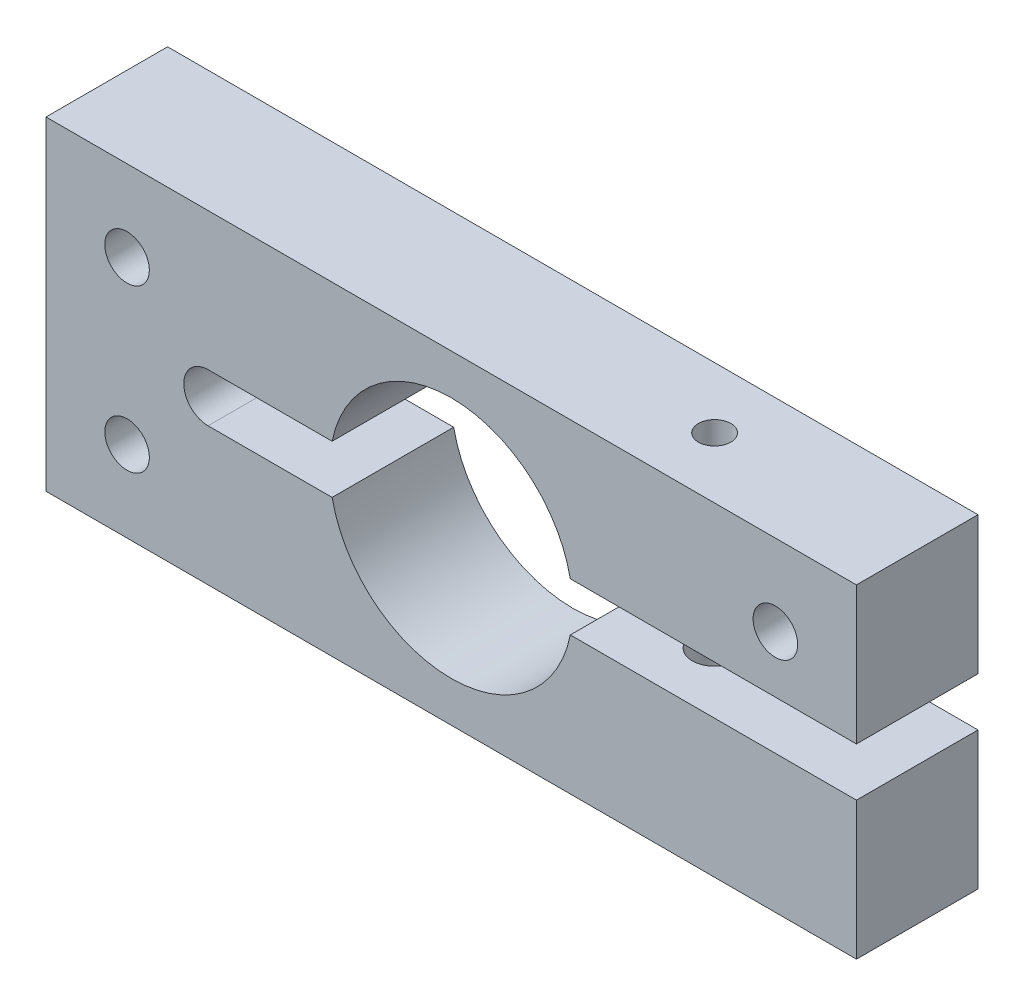
ISO-10303-21;
HEADER;
FILE_DESCRIPTION(('STEP AP214'),'2;1');
FILE_NAME('part.step','',(''),(''),'','','');
FILE_SCHEMA(('AUTOMOTIVE_DESIGN { 1 0 10303 214 1 1 1 1 }'));
ENDSEC;
DATA;
#1=APPLICATION_CONTEXT('core data for automotive mechanical design processes');
#2=APPLICATION_PROTOCOL_DEFINITION('international standard','automotive_design',2000,#1);
#3=PRODUCT_CONTEXT('',#1,'mechanical');
#4=PRODUCT('Part','Part','',(#3));
#5=PRODUCT_RELATED_PRODUCT_CATEGORY('part','',(#4));
#6=PRODUCT_DEFINITION_FORMATION('','',#4);
#7=PRODUCT_DEFINITION_CONTEXT('part definition',#1,'design');
#8=PRODUCT_DEFINITION('design','',#6,#7);
#9=PRODUCT_DEFINITION_SHAPE('','',#8);
#10=(LENGTH_UNIT() NAMED_UNIT(*) SI_UNIT(.MILLI.,.METRE.));
#11=(NAMED_UNIT(*) PLANE_ANGLE_UNIT() SI_UNIT($,.RADIAN.));
#12=(NAMED_UNIT(*) SI_UNIT($,.STERADIAN.) SOLID_ANGLE_UNIT());
#13=UNCERTAINTY_MEASURE_WITH_UNIT(LENGTH_MEASURE(1.E-05),#10,'distance_accuracy_value','');
#14=(GEOMETRIC_REPRESENTATION_CONTEXT(3) GLOBAL_UNCERTAINTY_ASSIGNED_CONTEXT((#13)) GLOBAL_UNIT_ASSIGNED_CONTEXT((#10,
#11,#12)) REPRESENTATION_CONTEXT('',''));
#15=CARTESIAN_POINT('',(0.,0.,0.));
#16=DIRECTION('',(0.,0.,1.));
#17=DIRECTION('',(1.,0.,0.));
#18=AXIS2_PLACEMENT_3D('',#15,#16,#17);
#19=CARTESIAN_POINT('',(50.,20.,0.));
#20=DIRECTION('',(0.,0.,1.));
#21=DIRECTION('',(1.,0.,0.));
#22=AXIS2_PLACEMENT_3D('',#19,#20,#21);
#23=PLANE('',#22);
#24=CARTESIAN_POINT('',(10.,30.,0.));
#25=DIRECTION('',(0.,0.,1.));
#26=DIRECTION('',(-1.,0.,0.));
#27=AXIS2_PLACEMENT_3D('',#24,#25,#26);
#28=CIRCLE('',#27,4.5);
#29=CARTESIAN_POINT('',(5.5,30.,0.));
#30=VERTEX_POINT('',#29);
#31=EDGE_CURVE('E216',#30,#30,#28,.T.);
#32=ORIENTED_EDGE('',*,*,#31,.T.);
#33=EDGE_LOOP('',(#32));
#34=FACE_BOUND('',#33,.T.);
#35=DIRECTION('',(0.,-1.,0.));
#36=VECTOR('',#35,1.);
#37=CARTESIAN_POINT('',(0.,0.,0.));
#38=LINE('',#37,#36);
#39=CARTESIAN_POINT('',(0.,40.,0.));
#40=VERTEX_POINT('',#39);
#41=CARTESIAN_POINT('',(0.,0.,0.));
#42=VERTEX_POINT('',#41);
#43=EDGE_CURVE('E156',#40,#42,#38,.T.);
#44=ORIENTED_EDGE('',*,*,#43,.F.);
#45=DIRECTION('',(-1.,0.,0.));
#46=VECTOR('',#45,1.);
#47=CARTESIAN_POINT('',(0.,40.,0.));
#48=LINE('',#47,#46);
#49=CARTESIAN_POINT('',(100.,40.,0.));
#50=VERTEX_POINT('',#49);
#51=EDGE_CURVE('E98',#50,#40,#48,.T.);
#52=ORIENTED_EDGE('',*,*,#51,.F.);
#53=DIRECTION('',(0.,1.,0.));
#54=VECTOR('',#53,1.);
#55=CARTESIAN_POINT('',(100.,23.,0.));
#56=LINE('',#55,#54);
#57=CARTESIAN_POINT('',(100.,23.,0.));
#58=VERTEX_POINT('',#57);
#59=EDGE_CURVE('E92',#58,#50,#56,.T.);
#60=ORIENTED_EDGE('',*,*,#59,.F.);
#61=DIRECTION('',(1.,0.,0.));
#62=VECTOR('',#61,1.);
#63=CARTESIAN_POINT('',(64.6969384566991,23.,0.));
#64=LINE('',#63,#62);
#65=CARTESIAN_POINT('',(64.6969384566991,23.,0.));
#66=VERTEX_POINT('',#65);
#67=EDGE_CURVE('E146',#66,#58,#64,.T.);
#68=ORIENTED_EDGE('',*,*,#67,.F.);
#69=CARTESIAN_POINT('',(50.,20.,0.));
#70=DIRECTION('',(0.,0.,-1.));
#71=DIRECTION('',(1.,0.,0.));
#72=AXIS2_PLACEMENT_3D('',#69,#70,#71);
#73=CIRCLE('',#72,15.);
#74=CARTESIAN_POINT('',(35.3030615433009,23.,0.));
#75=VERTEX_POINT('',#74);
#76=EDGE_CURVE('E174',#75,#66,#73,.T.);
#77=ORIENTED_EDGE('',*,*,#76,.F.);
#78=DIRECTION('',(1.,0.,0.));
#79=VECTOR('',#78,1.);
#80=CARTESIAN_POINT('',(20.,23.,0.));
#81=LINE('',#80,#79);
#82=CARTESIAN_POINT('',(20.,23.,0.));
#83=VERTEX_POINT('',#82);
#84=EDGE_CURVE('E172',#83,#75,#81,.T.);
#85=ORIENTED_EDGE('',*,*,#84,.F.);
#86=CARTESIAN_POINT('',(20.,20.,0.));
#87=DIRECTION('',(0.,0.,-1.));
#88=DIRECTION('',(1.,0.,0.));
#89=AXIS2_PLACEMENT_3D('',#86,#87,#88);
#90=CIRCLE('',#89,3.);
#91=CARTESIAN_POINT('',(20.,17.,0.));
#92=VERTEX_POINT('',#91);
#93=EDGE_CURVE('E170',#92,#83,#90,.T.);
#94=ORIENTED_EDGE('',*,*,#93,.F.);
#95=DIRECTION('',(-1.,0.,0.));
#96=VECTOR('',#95,1.);
#97=CARTESIAN_POINT('',(20.,17.,0.));
#98=LINE('',#97,#96);
#99=CARTESIAN_POINT('',(35.3030615433009,17.,0.));
#100=VERTEX_POINT('',#99);
#101=EDGE_CURVE('E168',#100,#92,#98,.T.);
#102=ORIENTED_EDGE('',*,*,#101,.F.);
#103=CARTESIAN_POINT('',(50.,20.,0.));
#104=DIRECTION('',(0.,0.,-1.));
#105=DIRECTION('',(1.,0.,0.));
#106=AXIS2_PLACEMENT_3D('',#103,#104,#105);
#107=CIRCLE('',#106,15.);
#108=CARTESIAN_POINT('',(64.6969384566991,17.,0.));
#109=VERTEX_POINT('',#108);
#110=EDGE_CURVE('E166',#109,#100,#107,.T.);
#111=ORIENTED_EDGE('',*,*,#110,.F.);
#112=DIRECTION('',(-1.,0.,0.));
#113=VECTOR('',#112,1.);
#114=CARTESIAN_POINT('',(64.6969384566991,17.,0.));
#115=LINE('',#114,#113);
#116=CARTESIAN_POINT('',(100.,17.,0.));
#117=VERTEX_POINT('',#116);
#118=EDGE_CURVE('E164',#117,#109,#115,.T.);
#119=ORIENTED_EDGE('',*,*,#118,.F.);
#120=DIRECTION('',(0.,1.,0.));
#121=VECTOR('',#120,1.);
#122=CARTESIAN_POINT('',(100.,0.,0.));
#123=LINE('',#122,#121);
#124=CARTESIAN_POINT('',(100.,0.,0.));
#125=VERTEX_POINT('',#124);
#126=EDGE_CURVE('E162',#125,#117,#123,.T.);
#127=ORIENTED_EDGE('',*,*,#126,.F.);
#128=DIRECTION('',(1.,0.,0.));
#129=VECTOR('',#128,1.);
#130=CARTESIAN_POINT('',(0.,0.,0.));
#131=LINE('',#130,#129);
#132=EDGE_CURVE('E159',#42,#125,#131,.T.);
#133=ORIENTED_EDGE('',*,*,#132,.F.);
#134=EDGE_LOOP('',(#44,#52,#60,#68,#77,#85,#94,#102,#111,#119,#127,#133));
#135=FACE_BOUND('',#134,.T.);
#136=CARTESIAN_POINT('',(10.,10.,0.));
#137=DIRECTION('',(0.,0.,1.));
#138=DIRECTION('',(1.,0.,0.));
#139=AXIS2_PLACEMENT_3D('',#136,#137,#138);
#140=CIRCLE('',#139,4.5);
#141=CARTESIAN_POINT('',(14.5,10.,0.));
#142=VERTEX_POINT('',#141);
#143=EDGE_CURVE('E209',#142,#142,#140,.T.);
#144=ORIENTED_EDGE('',*,*,#143,.T.);
#145=EDGE_LOOP('',(#144));
#146=FACE_BOUND('',#145,.T.);
#147=CARTESIAN_POINT('',(90.,30.,0.));
#148=DIRECTION('',(0.,0.,1.));
#149=DIRECTION('',(1.,0.,0.));
#150=AXIS2_PLACEMENT_3D('',#147,#148,#149);
#151=CIRCLE('',#150,4.49999999999999);
#152=CARTESIAN_POINT('',(94.5,30.,0.));
#153=VERTEX_POINT('',#152);
#154=EDGE_CURVE('E223',#153,#153,#151,.T.);
#155=ORIENTED_EDGE('',*,*,#154,.T.);
#156=EDGE_LOOP('',(#155));
#157=FACE_BOUND('',#156,.T.);
#158=ADVANCED_FACE('F32',(#34,#135,#146,#157),#23,.F.);
#159=CARTESIAN_POINT('',(10.,30.,15.));
#160=DIRECTION('',(0.,0.,-1.));
#161=DIRECTION('',(-1.,0.,0.));
#162=AXIS2_PLACEMENT_3D('',#159,#160,#161);
#163=CYLINDRICAL_SURFACE('',#162,2.75);
#164=CARTESIAN_POINT('',(10.,30.,15.));
#165=DIRECTION('',(0.,0.,1.));
#166=DIRECTION('',(1.,0.,0.));
#167=AXIS2_PLACEMENT_3D('',#164,#165,#166);
#168=CIRCLE('',#167,2.75);
#169=CARTESIAN_POINT('',(12.75,30.,15.));
#170=VERTEX_POINT('',#169);
#171=EDGE_CURVE('E160',#170,#170,#168,.T.);
#172=ORIENTED_EDGE('',*,*,#171,.T.);
#173=EDGE_LOOP('',(#172));
#174=FACE_BOUND('',#173,.T.);
#175=CARTESIAN_POINT('',(10.,30.,5.));
#176=DIRECTION('',(0.,0.,-1.));
#177=DIRECTION('',(-1.,0.,0.));
#178=AXIS2_PLACEMENT_3D('',#175,#176,#177);
#179=CIRCLE('',#178,2.75);
#180=CARTESIAN_POINT('',(7.25,30.,5.));
#181=VERTEX_POINT('',#180);
#182=EDGE_CURVE('E207',#181,#181,#179,.T.);
#183=ORIENTED_EDGE('',*,*,#182,.T.);
#184=EDGE_LOOP('',(#183));
#185=FACE_BOUND('',#184,.T.);
#186=ADVANCED_FACE('F292',(#174,#185),#163,.F.);
#187=CARTESIAN_POINT('',(50.,20.,15.));
#188=DIRECTION('',(0.,0.,1.));
#189=DIRECTION('',(1.,0.,0.));
#190=AXIS2_PLACEMENT_3D('',#187,#188,#189);
#191=PLANE('',#190);
#192=CARTESIAN_POINT('',(10.,10.,15.));
#193=DIRECTION('',(0.,0.,1.));
#194=DIRECTION('',(-1.,0.,0.));
#195=AXIS2_PLACEMENT_3D('',#192,#193,#194);
#196=CIRCLE('',#195,2.75);
#197=CARTESIAN_POINT('',(7.25,10.,15.));
#198=VERTEX_POINT('',#197);
#199=EDGE_CURVE('E242',#198,#198,#196,.T.);
#200=ORIENTED_EDGE('',*,*,#199,.F.);
#201=EDGE_LOOP('',(#200));
#202=FACE_BOUND('',#201,.T.);
#203=DIRECTION('',(0.,-1.,0.));
#204=VECTOR('',#203,1.);
#205=CARTESIAN_POINT('',(0.,0.,15.));
#206=LINE('',#205,#204);
#207=CARTESIAN_POINT('',(0.,40.,15.));
#208=VERTEX_POINT('',#207);
#209=CARTESIAN_POINT('',(0.,0.,15.));
#210=VERTEX_POINT('',#209);
#211=EDGE_CURVE('E179',#208,#210,#206,.T.);
#212=ORIENTED_EDGE('',*,*,#211,.T.);
#213=DIRECTION('',(1.,0.,0.));
#214=VECTOR('',#213,1.);
#215=CARTESIAN_POINT('',(0.,0.,15.));
#216=LINE('',#215,#214);
#217=CARTESIAN_POINT('',(100.,0.,15.));
#218=VERTEX_POINT('',#217);
#219=EDGE_CURVE('E106',#210,#218,#216,.T.);
#220=ORIENTED_EDGE('',*,*,#219,.T.);
#221=DIRECTION('',(0.,1.,0.));
#222=VECTOR('',#221,1.);
#223=CARTESIAN_POINT('',(100.,0.,15.));
#224=LINE('',#223,#222);
#225=CARTESIAN_POINT('',(100.,17.,15.));
#226=VERTEX_POINT('',#225);
#227=EDGE_CURVE('E249',#218,#226,#224,.T.);
#228=ORIENTED_EDGE('',*,*,#227,.T.);
#229=DIRECTION('',(-1.,0.,0.));
#230=VECTOR('',#229,1.);
#231=CARTESIAN_POINT('',(64.6969384566991,17.,15.));
#232=LINE('',#231,#230);
#233=CARTESIAN_POINT('',(64.6969384566991,17.,15.));
#234=VERTEX_POINT('',#233);
#235=EDGE_CURVE('E251',#226,#234,#232,.T.);
#236=ORIENTED_EDGE('',*,*,#235,.T.);
#237=CARTESIAN_POINT('',(50.,20.,15.));
#238=DIRECTION('',(0.,0.,-1.));
#239=DIRECTION('',(1.,0.,0.));
#240=AXIS2_PLACEMENT_3D('',#237,#238,#239);
#241=CIRCLE('',#240,15.);
#242=CARTESIAN_POINT('',(35.3030615433009,17.,15.));
#243=VERTEX_POINT('',#242);
#244=EDGE_CURVE('E253',#234,#243,#241,.T.);
#245=ORIENTED_EDGE('',*,*,#244,.T.);
#246=DIRECTION('',(-1.,0.,0.));
#247=VECTOR('',#246,1.);
#248=CARTESIAN_POINT('',(20.,17.,15.));
#249=LINE('',#248,#247);
#250=CARTESIAN_POINT('',(20.,17.,15.));
#251=VERTEX_POINT('',#250);
#252=EDGE_CURVE('E255',#243,#251,#249,.T.);
#253=ORIENTED_EDGE('',*,*,#252,.T.);
#254=CARTESIAN_POINT('',(20.,20.,15.));
#255=DIRECTION('',(0.,0.,-1.));
#256=DIRECTION('',(1.,0.,0.));
#257=AXIS2_PLACEMENT_3D('',#254,#255,#256);
#258=CIRCLE('',#257,3.);
#259=CARTESIAN_POINT('',(20.,23.,15.));
#260=VERTEX_POINT('',#259);
#261=EDGE_CURVE('E257',#251,#260,#258,.T.);
#262=ORIENTED_EDGE('',*,*,#261,.T.);
#263=DIRECTION('',(1.,0.,0.));
#264=VECTOR('',#263,1.);
#265=CARTESIAN_POINT('',(20.,23.,15.));
#266=LINE('',#265,#264);
#267=CARTESIAN_POINT('',(35.3030615433009,23.,15.));
#268=VERTEX_POINT('',#267);
#269=EDGE_CURVE('E259',#260,#268,#266,.T.);
#270=ORIENTED_EDGE('',*,*,#269,.T.);
#271=CARTESIAN_POINT('',(50.,20.,15.));
#272=DIRECTION('',(0.,0.,-1.));
#273=DIRECTION('',(1.,0.,0.));
#274=AXIS2_PLACEMENT_3D('',#271,#272,#273);
#275=CIRCLE('',#274,15.);
#276=CARTESIAN_POINT('',(64.6969384566991,23.,15.));
#277=VERTEX_POINT('',#276);
#278=EDGE_CURVE('E138',#268,#277,#275,.T.);
#279=ORIENTED_EDGE('',*,*,#278,.T.);
#280=DIRECTION('',(1.,0.,0.));
#281=VECTOR('',#280,1.);
#282=CARTESIAN_POINT('',(64.6969384566991,23.,15.));
#283=LINE('',#282,#281);
#284=CARTESIAN_POINT('',(100.,23.,15.));
#285=VERTEX_POINT('',#284);
#286=EDGE_CURVE('E131',#277,#285,#283,.T.);
#287=ORIENTED_EDGE('',*,*,#286,.T.);
#288=DIRECTION('',(0.,1.,0.));
#289=VECTOR('',#288,1.);
#290=CARTESIAN_POINT('',(100.,23.,15.));
#291=LINE('',#290,#289);
#292=CARTESIAN_POINT('',(100.,40.,15.));
#293=VERTEX_POINT('',#292);
#294=EDGE_CURVE('E136',#285,#293,#291,.T.);
#295=ORIENTED_EDGE('',*,*,#294,.T.);
#296=DIRECTION('',(-1.,0.,0.));
#297=VECTOR('',#296,1.);
#298=CARTESIAN_POINT('',(0.,40.,15.));
#299=LINE('',#298,#297);
#300=EDGE_CURVE('E51',#293,#208,#299,.T.);
#301=ORIENTED_EDGE('',*,*,#300,.T.);
#302=EDGE_LOOP('',(#212,#220,#228,#236,#245,#253,#262,#270,#279,#287,#295,#301));
#303=FACE_BOUND('',#302,.T.);
#304=ORIENTED_EDGE('',*,*,#171,.F.);
#305=EDGE_LOOP('',(#304));
#306=FACE_BOUND('',#305,.T.);
#307=CARTESIAN_POINT('',(90.,30.,15.));
#308=DIRECTION('',(0.,0.,1.));
#309=DIRECTION('',(-1.,0.,0.));
#310=AXIS2_PLACEMENT_3D('',#307,#308,#309);
#311=CIRCLE('',#310,2.74999999999999);
#312=CARTESIAN_POINT('',(87.25,30.,15.));
#313=VERTEX_POINT('',#312);
#314=EDGE_CURVE('E239',#313,#313,#311,.T.);
#315=ORIENTED_EDGE('',*,*,#314,.F.);
#316=EDGE_LOOP('',(#315));
#317=FACE_BOUND('',#316,.T.);
#318=ADVANCED_FACE('F133',(#202,#303,#306,#317),#191,.T.);
#319=CARTESIAN_POINT('',(0.,0.,15.));
#320=DIRECTION('',(1.,0.,0.));
#321=DIRECTION('',(0.,0.,-1.));
#322=AXIS2_PLACEMENT_3D('',#319,#320,#321);
#323=PLANE('',#322);
#324=ORIENTED_EDGE('',*,*,#43,.T.);
#325=DIRECTION('',(0.,0.,-1.));
#326=VECTOR('',#325,1.);
#327=CARTESIAN_POINT('',(0.,0.,15.));
#328=LINE('',#327,#326);
#329=EDGE_CURVE('E11',#210,#42,#328,.T.);
#330=ORIENTED_EDGE('',*,*,#329,.F.);
#331=ORIENTED_EDGE('',*,*,#211,.F.);
#332=DIRECTION('',(0.,0.,-1.));
#333=VECTOR('',#332,1.);
#334=CARTESIAN_POINT('',(0.,40.,15.));
#335=LINE('',#334,#333);
#336=EDGE_CURVE('E152',#208,#40,#335,.T.);
#337=ORIENTED_EDGE('',*,*,#336,.T.);
#338=EDGE_LOOP('',(#324,#330,#331,#337));
#339=FACE_BOUND('',#338,.T.);
#340=ADVANCED_FACE('F34',(#339),#323,.F.);
#341=CARTESIAN_POINT('',(0.,0.,15.));
#342=DIRECTION('',(0.,1.,0.));
#343=DIRECTION('',(0.,0.,1.));
#344=AXIS2_PLACEMENT_3D('',#341,#342,#343);
#345=PLANE('',#344);
#346=CARTESIAN_POINT('',(75.,0.,7.5));
#347=DIRECTION('',(0.,-1.,0.));
#348=DIRECTION('',(0.,0.,-1.));
#349=AXIS2_PLACEMENT_3D('',#346,#347,#348);
#350=CIRCLE('',#349,4.5);
#351=CARTESIAN_POINT('',(75.,0.,2.99999999999999));
#352=VERTEX_POINT('',#351);
#353=EDGE_CURVE('E205',#352,#352,#350,.T.);
#354=ORIENTED_EDGE('',*,*,#353,.F.);
#355=EDGE_LOOP('',(#354));
#356=FACE_BOUND('',#355,.T.);
#357=ORIENTED_EDGE('',*,*,#132,.T.);
#358=DIRECTION('',(0.,0.,-1.));
#359=VECTOR('',#358,1.);
#360=CARTESIAN_POINT('',(100.,0.,15.));
#361=LINE('',#360,#359);
#362=EDGE_CURVE('E42',#218,#125,#361,.T.);
#363=ORIENTED_EDGE('',*,*,#362,.F.);
#364=ORIENTED_EDGE('',*,*,#219,.F.);
#365=ORIENTED_EDGE('',*,*,#329,.T.);
#366=EDGE_LOOP('',(#357,#363,#364,#365));
#367=FACE_BOUND('',#366,.T.);
#368=ADVANCED_FACE('F404',(#356,#367),#345,.F.);
#369=CARTESIAN_POINT('',(100.,0.,15.));
#370=DIRECTION('',(-1.,0.,0.));
#371=DIRECTION('',(0.,0.,1.));
#372=AXIS2_PLACEMENT_3D('',#369,#370,#371);
#373=PLANE('',#372);
#374=ORIENTED_EDGE('',*,*,#126,.T.);
#375=DIRECTION('',(0.,0.,-1.));
#376=VECTOR('',#375,1.);
#377=CARTESIAN_POINT('',(100.,17.,15.));
#378=LINE('',#377,#376);
#379=EDGE_CURVE('E198',#226,#117,#378,.T.);
#380=ORIENTED_EDGE('',*,*,#379,.F.);
#381=ORIENTED_EDGE('',*,*,#227,.F.);
#382=ORIENTED_EDGE('',*,*,#362,.T.);
#383=EDGE_LOOP('',(#374,#380,#381,#382));
#384=FACE_BOUND('',#383,.T.);
#385=ADVANCED_FACE('F373',(#384),#373,.F.);
#386=CARTESIAN_POINT('',(64.6969384566991,17.,15.));
#387=DIRECTION('',(0.,-1.,0.));
#388=DIRECTION('',(0.,0.,-1.));
#389=AXIS2_PLACEMENT_3D('',#386,#387,#388);
#390=PLANE('',#389);
#391=CARTESIAN_POINT('',(75.,17.,7.5));
#392=DIRECTION('',(0.,-1.,0.));
#393=DIRECTION('',(0.,0.,-1.));
#394=AXIS2_PLACEMENT_3D('',#391,#392,#393);
#395=CIRCLE('',#394,2.75000000000001);
#396=CARTESIAN_POINT('',(75.,17.,4.74999999999999));
#397=VERTEX_POINT('',#396);
#398=EDGE_CURVE('E352',#397,#397,#395,.F.);
#399=ORIENTED_EDGE('',*,*,#398,.F.);
#400=EDGE_LOOP('',(#399));
#401=FACE_BOUND('',#400,.T.);
#402=ORIENTED_EDGE('',*,*,#118,.T.);
#403=DIRECTION('',(0.,0.,-1.));
#404=VECTOR('',#403,1.);
#405=CARTESIAN_POINT('',(64.6969384566991,17.,15.));
#406=LINE('',#405,#404);
#407=EDGE_CURVE('E195',#234,#109,#406,.T.);
#408=ORIENTED_EDGE('',*,*,#407,.F.);
#409=ORIENTED_EDGE('',*,*,#235,.F.);
#410=ORIENTED_EDGE('',*,*,#379,.T.);
#411=EDGE_LOOP('',(#402,#408,#409,#410));
#412=FACE_BOUND('',#411,.T.);
#413=ADVANCED_FACE('F369',(#401,#412),#390,.F.);
#414=CARTESIAN_POINT('',(50.,20.,15.));
#415=DIRECTION('',(0.,0.,-1.));
#416=DIRECTION('',(-1.,0.,0.));
#417=AXIS2_PLACEMENT_3D('',#414,#415,#416);
#418=CYLINDRICAL_SURFACE('',#417,15.);
#419=ORIENTED_EDGE('',*,*,#110,.T.);
#420=DIRECTION('',(0.,0.,-1.));
#421=VECTOR('',#420,1.);
#422=CARTESIAN_POINT('',(35.3030615433009,17.,15.));
#423=LINE('',#422,#421);
#424=EDGE_CURVE('E192',#243,#100,#423,.T.);
#425=ORIENTED_EDGE('',*,*,#424,.F.);
#426=ORIENTED_EDGE('',*,*,#244,.F.);
#427=ORIENTED_EDGE('',*,*,#407,.T.);
#428=EDGE_LOOP('',(#419,#425,#426,#427));
#429=FACE_BOUND('',#428,.T.);
#430=ADVANCED_FACE('F372',(#429),#418,.F.);
#431=CARTESIAN_POINT('',(20.,17.,15.));
#432=DIRECTION('',(0.,-1.,0.));
#433=DIRECTION('',(0.,0.,-1.));
#434=AXIS2_PLACEMENT_3D('',#431,#432,#433);
#435=PLANE('',#434);
#436=ORIENTED_EDGE('',*,*,#101,.T.);
#437=DIRECTION('',(0.,0.,-1.));
#438=VECTOR('',#437,1.);
#439=CARTESIAN_POINT('',(20.,17.,15.));
#440=LINE('',#439,#438);
#441=EDGE_CURVE('E189',#251,#92,#440,.T.);
#442=ORIENTED_EDGE('',*,*,#441,.F.);
#443=ORIENTED_EDGE('',*,*,#252,.F.);
#444=ORIENTED_EDGE('',*,*,#424,.T.);
#445=EDGE_LOOP('',(#436,#442,#443,#444));
#446=FACE_BOUND('',#445,.T.);
#447=ADVANCED_FACE('F387',(#446),#435,.F.);
#448=CARTESIAN_POINT('',(20.,20.,15.));
#449=DIRECTION('',(0.,0.,-1.));
#450=DIRECTION('',(-1.,0.,0.));
#451=AXIS2_PLACEMENT_3D('',#448,#449,#450);
#452=CYLINDRICAL_SURFACE('',#451,3.);
#453=ORIENTED_EDGE('',*,*,#93,.T.);
#454=DIRECTION('',(0.,0.,-1.));
#455=VECTOR('',#454,1.);
#456=CARTESIAN_POINT('',(20.,23.,15.));
#457=LINE('',#456,#455);
#458=EDGE_CURVE('E186',#260,#83,#457,.T.);
#459=ORIENTED_EDGE('',*,*,#458,.F.);
#460=ORIENTED_EDGE('',*,*,#261,.F.);
#461=ORIENTED_EDGE('',*,*,#441,.T.);
#462=EDGE_LOOP('',(#453,#459,#460,#461));
#463=FACE_BOUND('',#462,.T.);
#464=ADVANCED_FACE('F390',(#463),#452,.F.);
#465=CARTESIAN_POINT('',(20.,23.,15.));
#466=DIRECTION('',(0.,1.,0.));
#467=DIRECTION('',(0.,0.,1.));
#468=AXIS2_PLACEMENT_3D('',#465,#466,#467);
#469=PLANE('',#468);
#470=ORIENTED_EDGE('',*,*,#84,.T.);
#471=DIRECTION('',(0.,0.,-1.));
#472=VECTOR('',#471,1.);
#473=CARTESIAN_POINT('',(35.3030615433009,23.,15.));
#474=LINE('',#473,#472);
#475=EDGE_CURVE('E183',#268,#75,#474,.T.);
#476=ORIENTED_EDGE('',*,*,#475,.F.);
#477=ORIENTED_EDGE('',*,*,#269,.F.);
#478=ORIENTED_EDGE('',*,*,#458,.T.);
#479=EDGE_LOOP('',(#470,#476,#477,#478));
#480=FACE_BOUND('',#479,.T.);
#481=ADVANCED_FACE('F265',(#480),#469,.F.);
#482=CARTESIAN_POINT('',(50.,20.,15.));
#483=DIRECTION('',(0.,0.,-1.));
#484=DIRECTION('',(-1.,0.,0.));
#485=AXIS2_PLACEMENT_3D('',#482,#483,#484);
#486=CYLINDRICAL_SURFACE('',#485,15.);
#487=ORIENTED_EDGE('',*,*,#76,.T.);
#488=DIRECTION('',(0.,0.,-1.));
#489=VECTOR('',#488,1.);
#490=CARTESIAN_POINT('',(64.6969384566991,23.,15.));
#491=LINE('',#490,#489);
#492=EDGE_CURVE('E147',#277,#66,#491,.T.);
#493=ORIENTED_EDGE('',*,*,#492,.F.);
#494=ORIENTED_EDGE('',*,*,#278,.F.);
#495=ORIENTED_EDGE('',*,*,#475,.T.);
#496=EDGE_LOOP('',(#487,#493,#494,#495));
#497=FACE_BOUND('',#496,.T.);
#498=ADVANCED_FACE('F269',(#497),#486,.F.);
#499=CARTESIAN_POINT('',(64.6969384566991,23.,15.));
#500=DIRECTION('',(0.,1.,0.));
#501=DIRECTION('',(-1.,0.,0.));
#502=AXIS2_PLACEMENT_3D('',#499,#500,#501);
#503=PLANE('',#502);
#504=CARTESIAN_POINT('',(75.,23.,7.5));
#505=DIRECTION('',(0.,1.,0.));
#506=DIRECTION('',(-1.,0.,0.));
#507=AXIS2_PLACEMENT_3D('',#504,#505,#506);
#508=CIRCLE('',#507,2.);
#509=CARTESIAN_POINT('',(73.,23.,7.5));
#510=VERTEX_POINT('',#509);
#511=EDGE_CURVE('E236',#510,#510,#508,.T.);
#512=ORIENTED_EDGE('',*,*,#511,.T.);
#513=EDGE_LOOP('',(#512));
#514=FACE_BOUND('',#513,.T.);
#515=ORIENTED_EDGE('',*,*,#67,.T.);
#516=DIRECTION('',(0.,0.,-1.));
#517=VECTOR('',#516,1.);
#518=CARTESIAN_POINT('',(100.,23.,15.));
#519=LINE('',#518,#517);
#520=EDGE_CURVE('E143',#285,#58,#519,.T.);
#521=ORIENTED_EDGE('',*,*,#520,.F.);
#522=ORIENTED_EDGE('',*,*,#286,.F.);
#523=ORIENTED_EDGE('',*,*,#492,.T.);
#524=EDGE_LOOP('',(#515,#521,#522,#523));
#525=FACE_BOUND('',#524,.T.);
#526=ADVANCED_FACE('F144',(#514,#525),#503,.F.);
#527=CARTESIAN_POINT('',(100.,23.,15.));
#528=DIRECTION('',(-1.,0.,0.));
#529=DIRECTION('',(0.,0.,1.));
#530=AXIS2_PLACEMENT_3D('',#527,#528,#529);
#531=PLANE('',#530);
#532=ORIENTED_EDGE('',*,*,#59,.T.);
#533=DIRECTION('',(0.,0.,-1.));
#534=VECTOR('',#533,1.);
#535=CARTESIAN_POINT('',(100.,40.,15.));
#536=LINE('',#535,#534);
#537=EDGE_CURVE('E148',#293,#50,#536,.T.);
#538=ORIENTED_EDGE('',*,*,#537,.F.);
#539=ORIENTED_EDGE('',*,*,#294,.F.);
#540=ORIENTED_EDGE('',*,*,#520,.T.);
#541=EDGE_LOOP('',(#532,#538,#539,#540));
#542=FACE_BOUND('',#541,.T.);
#543=ADVANCED_FACE('F150',(#542),#531,.F.);
#544=CARTESIAN_POINT('',(0.,40.,15.));
#545=DIRECTION('',(0.,-1.,0.));
#546=DIRECTION('',(0.,0.,-1.));
#547=AXIS2_PLACEMENT_3D('',#544,#545,#546);
#548=PLANE('',#547);
#549=CARTESIAN_POINT('',(75.,40.,7.5));
#550=DIRECTION('',(0.,-1.,0.));
#551=DIRECTION('',(0.,0.,-1.));
#552=AXIS2_PLACEMENT_3D('',#549,#550,#551);
#553=CIRCLE('',#552,2.);
#554=CARTESIAN_POINT('',(75.,40.,5.5));
#555=VERTEX_POINT('',#554);
#556=EDGE_CURVE('E231',#555,#555,#553,.T.);
#557=ORIENTED_EDGE('',*,*,#556,.T.);
#558=EDGE_LOOP('',(#557));
#559=FACE_BOUND('',#558,.T.);
#560=ORIENTED_EDGE('',*,*,#51,.T.);
#561=ORIENTED_EDGE('',*,*,#336,.F.);
#562=ORIENTED_EDGE('',*,*,#300,.F.);
#563=ORIENTED_EDGE('',*,*,#537,.T.);
#564=EDGE_LOOP('',(#560,#561,#562,#563));
#565=FACE_BOUND('',#564,.T.);
#566=ADVANCED_FACE('F277',(#559,#565),#548,.F.);
#567=CARTESIAN_POINT('',(10.,10.,15.));
#568=DIRECTION('',(0.,0.,-1.));
#569=DIRECTION('',(-1.,0.,0.));
#570=AXIS2_PLACEMENT_3D('',#567,#568,#569);
#571=CYLINDRICAL_SURFACE('',#570,2.75);
#572=CARTESIAN_POINT('',(10.,10.,5.));
#573=DIRECTION('',(0.,0.,1.));
#574=DIRECTION('',(1.,0.,0.));
#575=AXIS2_PLACEMENT_3D('',#572,#573,#574);
#576=CIRCLE('',#575,2.75);
#577=CARTESIAN_POINT('',(12.75,10.,5.));
#578=VERTEX_POINT('',#577);
#579=EDGE_CURVE('E203',#578,#578,#576,.T.);
#580=ORIENTED_EDGE('',*,*,#579,.F.);
#581=EDGE_LOOP('',(#580));
#582=FACE_BOUND('',#581,.T.);
#583=ORIENTED_EDGE('',*,*,#199,.T.);
#584=EDGE_LOOP('',(#583));
#585=FACE_BOUND('',#584,.T.);
#586=ADVANCED_FACE('F279',(#582,#585),#571,.F.);
#587=CARTESIAN_POINT('',(90.,30.,15.));
#588=DIRECTION('',(0.,0.,-1.));
#589=DIRECTION('',(-1.,0.,0.));
#590=AXIS2_PLACEMENT_3D('',#587,#588,#589);
#591=CYLINDRICAL_SURFACE('',#590,2.74999999999999);
#592=CARTESIAN_POINT('',(90.,30.,5.));
#593=DIRECTION('',(0.,0.,1.));
#594=DIRECTION('',(1.,0.,0.));
#595=AXIS2_PLACEMENT_3D('',#592,#593,#594);
#596=CIRCLE('',#595,2.74999999999999);
#597=CARTESIAN_POINT('',(92.75,30.,5.));
#598=VERTEX_POINT('',#597);
#599=EDGE_CURVE('E36',#598,#598,#596,.T.);
#600=ORIENTED_EDGE('',*,*,#599,.F.);
#601=EDGE_LOOP('',(#600));
#602=FACE_BOUND('',#601,.T.);
#603=ORIENTED_EDGE('',*,*,#314,.T.);
#604=EDGE_LOOP('',(#603));
#605=FACE_BOUND('',#604,.T.);
#606=ADVANCED_FACE('F286',(#602,#605),#591,.F.);
#607=CARTESIAN_POINT('',(75.,40.,7.5));
#608=DIRECTION('',(0.,-1.,0.));
#609=DIRECTION('',(0.,0.,-1.));
#610=AXIS2_PLACEMENT_3D('',#607,#608,#609);
#611=CYLINDRICAL_SURFACE('',#610,2.);
#612=ORIENTED_EDGE('',*,*,#556,.F.);
#613=EDGE_LOOP('',(#612));
#614=FACE_BOUND('',#613,.T.);
#615=ORIENTED_EDGE('',*,*,#511,.F.);
#616=EDGE_LOOP('',(#615));
#617=FACE_BOUND('',#616,.T.);
#618=ADVANCED_FACE('F305',(#614,#617),#611,.F.);
#619=CARTESIAN_POINT('',(75.,5.,7.5));
#620=DIRECTION('',(0.,-1.,0.));
#621=DIRECTION('',(0.,0.,-1.));
#622=AXIS2_PLACEMENT_3D('',#619,#620,#621);
#623=PLANE('',#622);
#624=CARTESIAN_POINT('',(75.,5.,7.5));
#625=DIRECTION('',(0.,-1.,0.));
#626=DIRECTION('',(0.,0.,-1.));
#627=AXIS2_PLACEMENT_3D('',#624,#625,#626);
#628=CIRCLE('',#627,2.75000000000001);
#629=CARTESIAN_POINT('',(75.,5.,4.74999999999999));
#630=VERTEX_POINT('',#629);
#631=EDGE_CURVE('E349',#630,#630,#628,.T.);
#632=ORIENTED_EDGE('',*,*,#631,.F.);
#633=EDGE_LOOP('',(#632));
#634=FACE_BOUND('',#633,.T.);
#635=CARTESIAN_POINT('',(75.,5.,7.5));
#636=DIRECTION('',(0.,-1.,0.));
#637=DIRECTION('',(0.,0.,-1.));
#638=AXIS2_PLACEMENT_3D('',#635,#636,#637);
#639=CIRCLE('',#638,4.5);
#640=CARTESIAN_POINT('',(75.,5.,2.99999999999999));
#641=VERTEX_POINT('',#640);
#642=EDGE_CURVE('E228',#641,#641,#639,.T.);
#643=ORIENTED_EDGE('',*,*,#642,.T.);
#644=EDGE_LOOP('',(#643));
#645=FACE_BOUND('',#644,.T.);
#646=ADVANCED_FACE('F309',(#634,#645),#623,.T.);
#647=CARTESIAN_POINT('',(75.,5.,7.5));
#648=DIRECTION('',(0.,-1.,0.));
#649=DIRECTION('',(0.,0.,-1.));
#650=AXIS2_PLACEMENT_3D('',#647,#648,#649);
#651=CYLINDRICAL_SURFACE('',#650,4.5);
#652=ORIENTED_EDGE('',*,*,#642,.F.);
#653=EDGE_LOOP('',(#652));
#654=FACE_BOUND('',#653,.T.);
#655=ORIENTED_EDGE('',*,*,#353,.T.);
#656=EDGE_LOOP('',(#655));
#657=FACE_BOUND('',#656,.T.);
#658=ADVANCED_FACE('F311',(#654,#657),#651,.F.);
#659=CARTESIAN_POINT('',(10.,10.,5.));
#660=DIRECTION('',(0.,0.,-1.));
#661=DIRECTION('',(-1.,0.,0.));
#662=AXIS2_PLACEMENT_3D('',#659,#660,#661);
#663=CYLINDRICAL_SURFACE('',#662,4.5);
#664=CARTESIAN_POINT('',(10.,10.,5.));
#665=DIRECTION('',(0.,0.,1.));
#666=DIRECTION('',(1.,0.,0.));
#667=AXIS2_PLACEMENT_3D('',#664,#665,#666);
#668=CIRCLE('',#667,4.5);
#669=CARTESIAN_POINT('',(14.5,10.,5.));
#670=VERTEX_POINT('',#669);
#671=EDGE_CURVE('E206',#670,#670,#668,.T.);
#672=ORIENTED_EDGE('',*,*,#671,.T.);
#673=EDGE_LOOP('',(#672));
#674=FACE_BOUND('',#673,.T.);
#675=ORIENTED_EDGE('',*,*,#143,.F.);
#676=EDGE_LOOP('',(#675));
#677=FACE_BOUND('',#676,.T.);
#678=ADVANCED_FACE('F314',(#674,#677),#663,.F.);
#679=CARTESIAN_POINT('',(10.,10.,5.));
#680=DIRECTION('',(0.,0.,1.));
#681=DIRECTION('',(1.,0.,0.));
#682=AXIS2_PLACEMENT_3D('',#679,#680,#681);
#683=PLANE('',#682);
#684=ORIENTED_EDGE('',*,*,#579,.T.);
#685=EDGE_LOOP('',(#684));
#686=FACE_BOUND('',#685,.T.);
#687=ORIENTED_EDGE('',*,*,#671,.F.);
#688=EDGE_LOOP('',(#687));
#689=FACE_BOUND('',#688,.T.);
#690=ADVANCED_FACE('F321',(#686,#689),#683,.F.);
#691=CARTESIAN_POINT('',(10.,30.,5.));
#692=DIRECTION('',(0.,0.,-1.));
#693=DIRECTION('',(-1.,0.,0.));
#694=AXIS2_PLACEMENT_3D('',#691,#692,#693);
#695=CYLINDRICAL_SURFACE('',#694,4.5);
#696=CARTESIAN_POINT('',(10.,30.,5.));
#697=DIRECTION('',(0.,0.,1.));
#698=DIRECTION('',(-1.,0.,0.));
#699=AXIS2_PLACEMENT_3D('',#696,#697,#698);
#700=CIRCLE('',#699,4.5);
#701=CARTESIAN_POINT('',(5.5,30.,5.));
#702=VERTEX_POINT('',#701);
#703=EDGE_CURVE('E210',#702,#702,#700,.T.);
#704=ORIENTED_EDGE('',*,*,#703,.T.);
#705=EDGE_LOOP('',(#704));
#706=FACE_BOUND('',#705,.T.);
#707=ORIENTED_EDGE('',*,*,#31,.F.);
#708=EDGE_LOOP('',(#707));
#709=FACE_BOUND('',#708,.T.);
#710=ADVANCED_FACE('F325',(#706,#709),#695,.F.);
#711=CARTESIAN_POINT('',(10.,30.,5.));
#712=DIRECTION('',(0.,0.,-1.));
#713=DIRECTION('',(-1.,0.,0.));
#714=AXIS2_PLACEMENT_3D('',#711,#712,#713);
#715=PLANE('',#714);
#716=ORIENTED_EDGE('',*,*,#182,.F.);
#717=EDGE_LOOP('',(#716));
#718=FACE_BOUND('',#717,.T.);
#719=ORIENTED_EDGE('',*,*,#703,.F.);
#720=EDGE_LOOP('',(#719));
#721=FACE_BOUND('',#720,.T.);
#722=ADVANCED_FACE('F329',(#718,#721),#715,.T.);
#723=CARTESIAN_POINT('',(90.,30.,5.));
#724=DIRECTION('',(0.,0.,-1.));
#725=DIRECTION('',(-1.,0.,0.));
#726=AXIS2_PLACEMENT_3D('',#723,#724,#725);
#727=CYLINDRICAL_SURFACE('',#726,4.49999999999999);
#728=CARTESIAN_POINT('',(90.,30.,5.));
#729=DIRECTION('',(0.,0.,1.));
#730=DIRECTION('',(1.,0.,0.));
#731=AXIS2_PLACEMENT_3D('',#728,#729,#730);
#732=CIRCLE('',#731,4.49999999999999);
#733=CARTESIAN_POINT('',(94.5,30.,5.));
#734=VERTEX_POINT('',#733);
#735=EDGE_CURVE('E356',#734,#734,#732,.T.);
#736=ORIENTED_EDGE('',*,*,#735,.T.);
#737=EDGE_LOOP('',(#736));
#738=FACE_BOUND('',#737,.T.);
#739=ORIENTED_EDGE('',*,*,#154,.F.);
#740=EDGE_LOOP('',(#739));
#741=FACE_BOUND('',#740,.T.);
#742=ADVANCED_FACE('F332',(#738,#741),#727,.F.);
#743=CARTESIAN_POINT('',(90.,30.,5.));
#744=DIRECTION('',(0.,0.,1.));
#745=DIRECTION('',(1.,0.,0.));
#746=AXIS2_PLACEMENT_3D('',#743,#744,#745);
#747=PLANE('',#746);
#748=ORIENTED_EDGE('',*,*,#599,.T.);
#749=EDGE_LOOP('',(#748));
#750=FACE_BOUND('',#749,.T.);
#751=ORIENTED_EDGE('',*,*,#735,.F.);
#752=EDGE_LOOP('',(#751));
#753=FACE_BOUND('',#752,.T.);
#754=ADVANCED_FACE('F336',(#750,#753),#747,.F.);
#755=CARTESIAN_POINT('',(75.,40.001,7.5));
#756=DIRECTION('',(0.,-1.,0.));
#757=DIRECTION('',(0.,0.,-1.));
#758=AXIS2_PLACEMENT_3D('',#755,#756,#757);
#759=CYLINDRICAL_SURFACE('',#758,2.75000000000001);
#760=ORIENTED_EDGE('',*,*,#631,.T.);
#761=EDGE_LOOP('',(#760));
#762=FACE_BOUND('',#761,.T.);
#763=ORIENTED_EDGE('',*,*,#398,.T.);
#764=EDGE_LOOP('',(#763));
#765=FACE_BOUND('',#764,.T.);
#766=ADVANCED_FACE('F340',(#762,#765),#759,.F.);
#767=CLOSED_SHELL('',(#158,#186,#318,#340,#368,#385,#413,#430,#447,#464,#481,#498,#526,#543,
#566,#586,#606,#618,#646,#658,#678,#690,#710,#722,#742,#754,#766));
#768=MANIFOLD_SOLID_BREP('B2',#767);
#769=ADVANCED_BREP_SHAPE_REPRESENTATION('',(#18,#768),#14);
#770=SHAPE_DEFINITION_REPRESENTATION(#9,#769);
ENDSEC;
END-ISO-10303-21;
